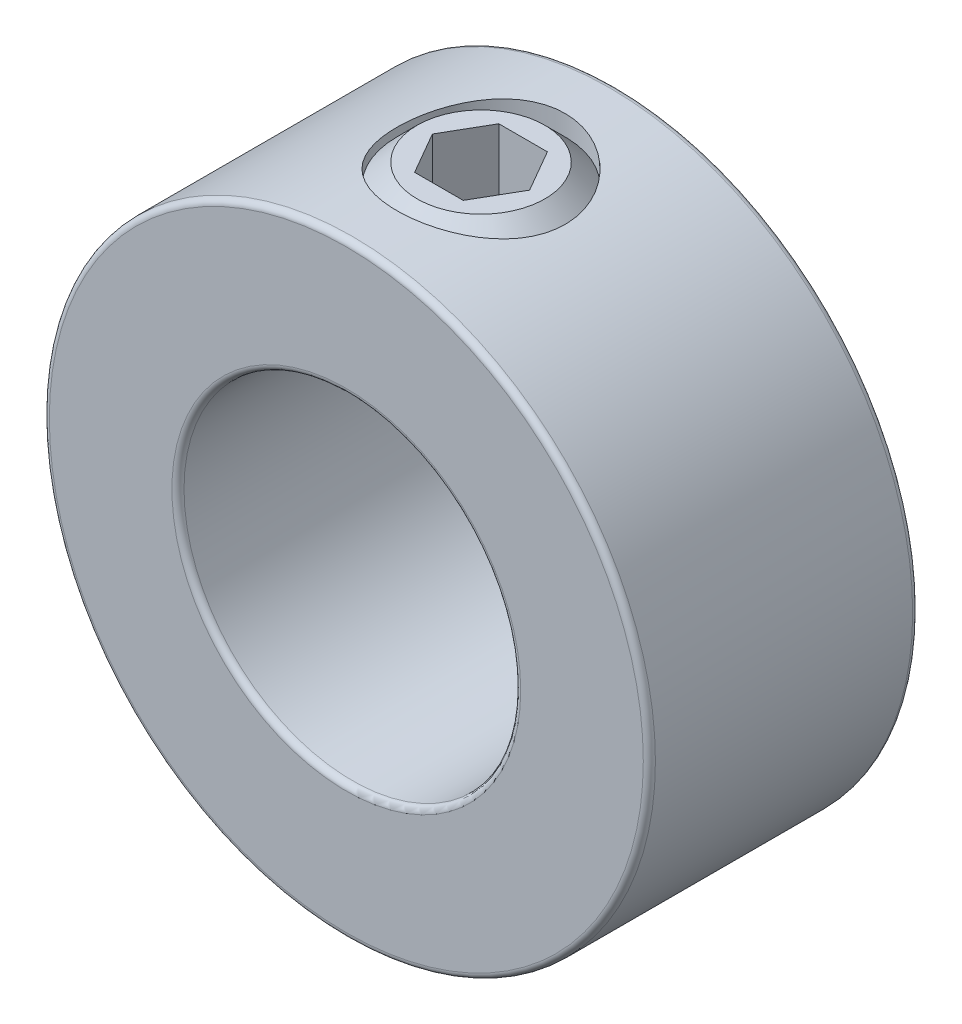
ISO-10303-21;
HEADER;
FILE_DESCRIPTION(('STEP AP214'),'2;1');
FILE_NAME('part.step','',(''),(''),'','','');
FILE_SCHEMA(('AUTOMOTIVE_DESIGN { 1 0 10303 214 1 1 1 1 }'));
ENDSEC;
DATA;
#1=APPLICATION_CONTEXT('core data for automotive mechanical design processes');
#2=APPLICATION_PROTOCOL_DEFINITION('international standard','automotive_design',2000,#1);
#3=PRODUCT_CONTEXT('',#1,'mechanical');
#4=PRODUCT('Part','Part','',(#3));
#5=PRODUCT_RELATED_PRODUCT_CATEGORY('part','',(#4));
#6=PRODUCT_DEFINITION_FORMATION('','',#4);
#7=PRODUCT_DEFINITION_CONTEXT('part definition',#1,'design');
#8=PRODUCT_DEFINITION('design','',#6,#7);
#9=PRODUCT_DEFINITION_SHAPE('','',#8);
#10=(LENGTH_UNIT() NAMED_UNIT(*) SI_UNIT(.MILLI.,.METRE.));
#11=(NAMED_UNIT(*) PLANE_ANGLE_UNIT() SI_UNIT($,.RADIAN.));
#12=(NAMED_UNIT(*) SI_UNIT($,.STERADIAN.) SOLID_ANGLE_UNIT());
#13=UNCERTAINTY_MEASURE_WITH_UNIT(LENGTH_MEASURE(1.E-05),#10,'distance_accuracy_value','');
#14=(GEOMETRIC_REPRESENTATION_CONTEXT(3) GLOBAL_UNCERTAINTY_ASSIGNED_CONTEXT((#13)) GLOBAL_UNIT_ASSIGNED_CONTEXT((#10,
#11,#12)) REPRESENTATION_CONTEXT('',''));
#15=CARTESIAN_POINT('',(0.,0.,0.));
#16=DIRECTION('',(0.,0.,1.));
#17=DIRECTION('',(1.,0.,0.));
#18=AXIS2_PLACEMENT_3D('',#15,#16,#17);
#19=CARTESIAN_POINT('',(0.,14.2875,0.));
#20=DIRECTION('',(0.,1.,0.));
#21=DIRECTION('',(-1.,0.,0.));
#22=AXIS2_PLACEMENT_3D('',#19,#20,#21);
#23=PLANE('',#22);
#24=CARTESIAN_POINT('',(0.,14.2875,0.));
#25=DIRECTION('',(0.,1.,0.));
#26=DIRECTION('',(-1.,0.,0.));
#27=AXIS2_PLACEMENT_3D('',#24,#25,#26);
#28=CIRCLE('',#27,3.01024078905505);
#29=CARTESIAN_POINT('',(-3.01024078905505,14.2875,0.));
#30=VERTEX_POINT('',#29);
#31=EDGE_CURVE('E125',#30,#30,#28,.T.);
#32=ORIENTED_EDGE('',*,*,#31,.T.);
#33=EDGE_LOOP('',(#32));
#34=FACE_BOUND('',#33,.T.);
#35=DIRECTION('',(1.,0.,0.));
#36=VECTOR('',#35,1.);
#37=CARTESIAN_POINT('',(-1.14567944042316,14.2875,-1.984375));
#38=LINE('',#37,#36);
#39=CARTESIAN_POINT('',(-1.14567944042316,14.2875,-1.984375));
#40=VERTEX_POINT('',#39);
#41=CARTESIAN_POINT('',(1.14567944042316,14.2875,-1.984375));
#42=VERTEX_POINT('',#41);
#43=EDGE_CURVE('E120',#40,#42,#38,.T.);
#44=ORIENTED_EDGE('',*,*,#43,.T.);
#45=DIRECTION('',(0.5,0.,0.866025403784439));
#46=VECTOR('',#45,1.);
#47=CARTESIAN_POINT('',(1.14567944042316,14.2875,-1.984375));
#48=LINE('',#47,#46);
#49=CARTESIAN_POINT('',(2.29135888084633,14.2875,0.));
#50=VERTEX_POINT('',#49);
#51=EDGE_CURVE('E66',#42,#50,#48,.T.);
#52=ORIENTED_EDGE('',*,*,#51,.T.);
#53=DIRECTION('',(-0.5,0.,0.866025403784439));
#54=VECTOR('',#53,1.);
#55=CARTESIAN_POINT('',(2.29135888084633,14.2875,0.));
#56=LINE('',#55,#54);
#57=CARTESIAN_POINT('',(1.14567944042317,14.2875,1.984375));
#58=VERTEX_POINT('',#57);
#59=EDGE_CURVE('E124',#50,#58,#56,.T.);
#60=ORIENTED_EDGE('',*,*,#59,.T.);
#61=DIRECTION('',(-1.,0.,0.));
#62=VECTOR('',#61,1.);
#63=CARTESIAN_POINT('',(1.14567944042317,14.2875,1.984375));
#64=LINE('',#63,#62);
#65=CARTESIAN_POINT('',(-1.14567944042316,14.2875,1.984375));
#66=VERTEX_POINT('',#65);
#67=EDGE_CURVE('E248',#58,#66,#64,.T.);
#68=ORIENTED_EDGE('',*,*,#67,.T.);
#69=DIRECTION('',(-0.5,0.,-0.866025403784439));
#70=VECTOR('',#69,1.);
#71=CARTESIAN_POINT('',(-1.14567944042316,14.2875,1.984375));
#72=LINE('',#71,#70);
#73=CARTESIAN_POINT('',(-2.29135888084633,14.2875,0.));
#74=VERTEX_POINT('',#73);
#75=EDGE_CURVE('E245',#66,#74,#72,.T.);
#76=ORIENTED_EDGE('',*,*,#75,.T.);
#77=DIRECTION('',(0.5,0.,-0.866025403784439));
#78=VECTOR('',#77,1.);
#79=CARTESIAN_POINT('',(-2.29135888084633,14.2875,0.));
#80=LINE('',#79,#78);
#81=EDGE_CURVE('E239',#74,#40,#80,.T.);
#82=ORIENTED_EDGE('',*,*,#81,.T.);
#83=EDGE_LOOP('',(#44,#52,#60,#68,#76,#82));
#84=FACE_BOUND('',#83,.T.);
#85=ADVANCED_FACE('F51',(#34,#84),#23,.T.);
#86=CARTESIAN_POINT('',(0.,7.9375,0.));
#87=DIRECTION('',(0.,-1.,0.));
#88=DIRECTION('',(1.,0.,0.));
#89=AXIS2_PLACEMENT_3D('',#86,#87,#88);
#90=CONICAL_SURFACE('',#89,1.15021105313395,0.785398163397449);
#91=CARTESIAN_POINT('',(0.,9.08771105313395,0.));
#92=VERTEX_POINT('',#91);
#93=VERTEX_LOOP('',#92);
#94=FACE_BOUND('',#93,.T.);
#95=CARTESIAN_POINT('',(0.,7.9375,0.));
#96=DIRECTION('',(0.,1.,0.));
#97=DIRECTION('',(-1.,0.,0.));
#98=AXIS2_PLACEMENT_3D('',#95,#96,#97);
#99=CIRCLE('',#98,1.15021105313395);
#100=CARTESIAN_POINT('',(-1.15021105313395,7.9375,0.));
#101=VERTEX_POINT('',#100);
#102=EDGE_CURVE('E12',#101,#101,#99,.T.);
#103=ORIENTED_EDGE('',*,*,#102,.F.);
#104=EDGE_LOOP('',(#103));
#105=FACE_BOUND('',#104,.T.);
#106=ADVANCED_FACE('F53',(#94,#105),#90,.F.);
#107=CARTESIAN_POINT('',(-3.01024078905505,7.9375,0.));
#108=DIRECTION('',(0.,-1.,0.));
#109=DIRECTION('',(1.,0.,0.));
#110=AXIS2_PLACEMENT_3D('',#107,#108,#109);
#111=PLANE('',#110);
#112=ORIENTED_EDGE('',*,*,#102,.T.);
#113=EDGE_LOOP('',(#112));
#114=FACE_BOUND('',#113,.T.);
#115=CARTESIAN_POINT('',(0.,7.9375,0.));
#116=DIRECTION('',(0.,1.,0.));
#117=DIRECTION('',(-1.,0.,0.));
#118=AXIS2_PLACEMENT_3D('',#115,#116,#117);
#119=CIRCLE('',#118,3.01024078905505);
#120=CARTESIAN_POINT('',(-3.01024078905505,7.9375,0.));
#121=VERTEX_POINT('',#120);
#122=EDGE_CURVE('E59',#121,#121,#119,.T.);
#123=ORIENTED_EDGE('',*,*,#122,.F.);
#124=EDGE_LOOP('',(#123));
#125=FACE_BOUND('',#124,.T.);
#126=ADVANCED_FACE('F145',(#114,#125),#111,.T.);
#127=CARTESIAN_POINT('',(0.,8.89600921094495,0.));
#128=DIRECTION('',(0.,1.,0.));
#129=DIRECTION('',(-1.,0.,0.));
#130=AXIS2_PLACEMENT_3D('',#127,#128,#129);
#131=CONICAL_SURFACE('',#130,3.96875,0.785398163397449);
#132=ORIENTED_EDGE('',*,*,#122,.T.);
#133=EDGE_LOOP('',(#132));
#134=FACE_BOUND('',#133,.T.);
#135=CARTESIAN_POINT('',(0.,8.89600921094495,0.));
#136=DIRECTION('',(0.,1.,0.));
#137=DIRECTION('',(-1.,0.,0.));
#138=AXIS2_PLACEMENT_3D('',#135,#136,#137);
#139=CIRCLE('',#138,3.96875);
#140=CARTESIAN_POINT('',(-3.96875,8.89600921094495,0.));
#141=VERTEX_POINT('',#140);
#142=EDGE_CURVE('E137',#141,#141,#139,.T.);
#143=ORIENTED_EDGE('',*,*,#142,.F.);
#144=EDGE_LOOP('',(#143));
#145=FACE_BOUND('',#144,.T.);
#146=ADVANCED_FACE('F142',(#134,#145),#131,.T.);
#147=CARTESIAN_POINT('',(0.,7.9375,0.));
#148=DIRECTION('',(0.,1.,0.));
#149=DIRECTION('',(-1.,0.,0.));
#150=AXIS2_PLACEMENT_3D('',#147,#148,#149);
#151=CYLINDRICAL_SURFACE('',#150,3.96875);
#152=ORIENTED_EDGE('',*,*,#142,.T.);
#153=EDGE_LOOP('',(#152));
#154=FACE_BOUND('',#153,.T.);
#155=CARTESIAN_POINT('',(0.,13.328990789055,0.));
#156=DIRECTION('',(0.,1.,0.));
#157=DIRECTION('',(-1.,0.,0.));
#158=AXIS2_PLACEMENT_3D('',#155,#156,#157);
#159=CIRCLE('',#158,3.96875);
#160=CARTESIAN_POINT('',(-3.96875,13.328990789055,0.));
#161=VERTEX_POINT('',#160);
#162=EDGE_CURVE('E129',#161,#161,#159,.T.);
#163=ORIENTED_EDGE('',*,*,#162,.F.);
#164=EDGE_LOOP('',(#163));
#165=FACE_BOUND('',#164,.T.);
#166=ADVANCED_FACE('F152',(#154,#165),#151,.T.);
#167=CARTESIAN_POINT('',(0.,14.2875,0.));
#168=DIRECTION('',(0.,-1.,0.));
#169=DIRECTION('',(1.,0.,0.));
#170=AXIS2_PLACEMENT_3D('',#167,#168,#169);
#171=CONICAL_SURFACE('',#170,3.01024078905505,0.785398163397448);
#172=ORIENTED_EDGE('',*,*,#162,.T.);
#173=EDGE_LOOP('',(#172));
#174=FACE_BOUND('',#173,.T.);
#175=ORIENTED_EDGE('',*,*,#31,.F.);
#176=EDGE_LOOP('',(#175));
#177=FACE_BOUND('',#176,.T.);
#178=ADVANCED_FACE('F165',(#174,#177),#171,.T.);
#179=CARTESIAN_POINT('',(1.14567944042316,10.31875,-1.984375));
#180=DIRECTION('',(-0.866025403784439,0.,0.5));
#181=DIRECTION('',(0.5,0.,0.866025403784439));
#182=AXIS2_PLACEMENT_3D('',#179,#180,#181);
#183=PLANE('',#182);
#184=ORIENTED_EDGE('',*,*,#51,.F.);
#185=DIRECTION('',(0.,1.,0.));
#186=VECTOR('',#185,1.);
#187=CARTESIAN_POINT('',(1.14567944042316,10.31875,-1.984375));
#188=LINE('',#187,#186);
#189=CARTESIAN_POINT('',(1.14567944042316,10.31875,-1.984375));
#190=VERTEX_POINT('',#189);
#191=EDGE_CURVE('E119',#190,#42,#188,.T.);
#192=ORIENTED_EDGE('',*,*,#191,.F.);
#193=DIRECTION('',(0.5,0.,0.866025403784439));
#194=VECTOR('',#193,1.);
#195=CARTESIAN_POINT('',(1.14567944042316,10.31875,-1.984375));
#196=LINE('',#195,#194);
#197=CARTESIAN_POINT('',(2.29135888084633,10.31875,0.));
#198=VERTEX_POINT('',#197);
#199=EDGE_CURVE('E110',#190,#198,#196,.T.);
#200=ORIENTED_EDGE('',*,*,#199,.T.);
#201=DIRECTION('',(0.,1.,0.));
#202=VECTOR('',#201,1.);
#203=CARTESIAN_POINT('',(2.29135888084633,10.31875,0.));
#204=LINE('',#203,#202);
#205=EDGE_CURVE('E118',#198,#50,#204,.T.);
#206=ORIENTED_EDGE('',*,*,#205,.T.);
#207=EDGE_LOOP('',(#184,#192,#200,#206));
#208=FACE_BOUND('',#207,.T.);
#209=ADVANCED_FACE('F117',(#208),#183,.T.);
#210=CARTESIAN_POINT('',(2.29135888084633,10.31875,0.));
#211=DIRECTION('',(-0.866025403784439,0.,-0.5));
#212=DIRECTION('',(-0.5,0.,0.866025403784439));
#213=AXIS2_PLACEMENT_3D('',#210,#211,#212);
#214=PLANE('',#213);
#215=ORIENTED_EDGE('',*,*,#59,.F.);
#216=ORIENTED_EDGE('',*,*,#205,.F.);
#217=DIRECTION('',(-0.5,0.,0.866025403784439));
#218=VECTOR('',#217,1.);
#219=CARTESIAN_POINT('',(2.29135888084633,10.31875,0.));
#220=LINE('',#219,#218);
#221=CARTESIAN_POINT('',(1.14567944042317,10.31875,1.984375));
#222=VERTEX_POINT('',#221);
#223=EDGE_CURVE('E106',#198,#222,#220,.T.);
#224=ORIENTED_EDGE('',*,*,#223,.T.);
#225=DIRECTION('',(0.,1.,0.));
#226=VECTOR('',#225,1.);
#227=CARTESIAN_POINT('',(1.14567944042317,10.31875,1.984375));
#228=LINE('',#227,#226);
#229=EDGE_CURVE('E126',#222,#58,#228,.T.);
#230=ORIENTED_EDGE('',*,*,#229,.T.);
#231=EDGE_LOOP('',(#215,#216,#224,#230));
#232=FACE_BOUND('',#231,.T.);
#233=ADVANCED_FACE('F122',(#232),#214,.T.);
#234=CARTESIAN_POINT('',(1.14567944042317,10.31875,1.984375));
#235=DIRECTION('',(0.,0.,-1.));
#236=DIRECTION('',(-1.,0.,0.));
#237=AXIS2_PLACEMENT_3D('',#234,#235,#236);
#238=PLANE('',#237);
#239=ORIENTED_EDGE('',*,*,#67,.F.);
#240=ORIENTED_EDGE('',*,*,#229,.F.);
#241=DIRECTION('',(-1.,0.,0.));
#242=VECTOR('',#241,1.);
#243=CARTESIAN_POINT('',(1.14567944042317,10.31875,1.984375));
#244=LINE('',#243,#242);
#245=CARTESIAN_POINT('',(-1.14567944042316,10.31875,1.984375));
#246=VERTEX_POINT('',#245);
#247=EDGE_CURVE('E112',#222,#246,#244,.T.);
#248=ORIENTED_EDGE('',*,*,#247,.T.);
#249=DIRECTION('',(0.,1.,0.));
#250=VECTOR('',#249,1.);
#251=CARTESIAN_POINT('',(-1.14567944042316,10.31875,1.984375));
#252=LINE('',#251,#250);
#253=EDGE_CURVE('E131',#246,#66,#252,.T.);
#254=ORIENTED_EDGE('',*,*,#253,.T.);
#255=EDGE_LOOP('',(#239,#240,#248,#254));
#256=FACE_BOUND('',#255,.T.);
#257=ADVANCED_FACE('F196',(#256),#238,.T.);
#258=CARTESIAN_POINT('',(-1.14567944042316,10.31875,1.984375));
#259=DIRECTION('',(0.866025403784439,0.,-0.5));
#260=DIRECTION('',(-0.5,0.,-0.866025403784439));
#261=AXIS2_PLACEMENT_3D('',#258,#259,#260);
#262=PLANE('',#261);
#263=ORIENTED_EDGE('',*,*,#75,.F.);
#264=ORIENTED_EDGE('',*,*,#253,.F.);
#265=DIRECTION('',(-0.5,0.,-0.866025403784439));
#266=VECTOR('',#265,1.);
#267=CARTESIAN_POINT('',(-1.14567944042316,10.31875,1.984375));
#268=LINE('',#267,#266);
#269=CARTESIAN_POINT('',(-2.29135888084633,10.31875,0.));
#270=VERTEX_POINT('',#269);
#271=EDGE_CURVE('E264',#246,#270,#268,.T.);
#272=ORIENTED_EDGE('',*,*,#271,.T.);
#273=DIRECTION('',(0.,1.,0.));
#274=VECTOR('',#273,1.);
#275=CARTESIAN_POINT('',(-2.29135888084633,10.31875,0.));
#276=LINE('',#275,#274);
#277=EDGE_CURVE('E255',#270,#74,#276,.T.);
#278=ORIENTED_EDGE('',*,*,#277,.T.);
#279=EDGE_LOOP('',(#263,#264,#272,#278));
#280=FACE_BOUND('',#279,.T.);
#281=ADVANCED_FACE('F202',(#280),#262,.T.);
#282=CARTESIAN_POINT('',(-2.29135888084633,10.31875,0.));
#283=DIRECTION('',(0.866025403784439,0.,0.5));
#284=DIRECTION('',(0.5,0.,-0.866025403784439));
#285=AXIS2_PLACEMENT_3D('',#282,#283,#284);
#286=PLANE('',#285);
#287=ORIENTED_EDGE('',*,*,#81,.F.);
#288=ORIENTED_EDGE('',*,*,#277,.F.);
#289=DIRECTION('',(0.5,0.,-0.866025403784439));
#290=VECTOR('',#289,1.);
#291=CARTESIAN_POINT('',(-2.29135888084633,10.31875,0.));
#292=LINE('',#291,#290);
#293=CARTESIAN_POINT('',(-1.14567944042316,10.31875,-1.984375));
#294=VERTEX_POINT('',#293);
#295=EDGE_CURVE('E262',#270,#294,#292,.T.);
#296=ORIENTED_EDGE('',*,*,#295,.T.);
#297=DIRECTION('',(0.,1.,0.));
#298=VECTOR('',#297,1.);
#299=CARTESIAN_POINT('',(-1.14567944042316,10.31875,-1.984375));
#300=LINE('',#299,#298);
#301=EDGE_CURVE('E238',#294,#40,#300,.T.);
#302=ORIENTED_EDGE('',*,*,#301,.T.);
#303=EDGE_LOOP('',(#287,#288,#296,#302));
#304=FACE_BOUND('',#303,.T.);
#305=ADVANCED_FACE('F210',(#304),#286,.T.);
#306=CARTESIAN_POINT('',(-1.14567944042316,10.31875,-1.984375));
#307=DIRECTION('',(0.,0.,1.));
#308=DIRECTION('',(1.,0.,0.));
#309=AXIS2_PLACEMENT_3D('',#306,#307,#308);
#310=PLANE('',#309);
#311=ORIENTED_EDGE('',*,*,#43,.F.);
#312=ORIENTED_EDGE('',*,*,#301,.F.);
#313=DIRECTION('',(1.,0.,0.));
#314=VECTOR('',#313,1.);
#315=CARTESIAN_POINT('',(-1.14567944042316,10.31875,-1.984375));
#316=LINE('',#315,#314);
#317=EDGE_CURVE('E253',#294,#190,#316,.T.);
#318=ORIENTED_EDGE('',*,*,#317,.T.);
#319=ORIENTED_EDGE('',*,*,#191,.T.);
#320=EDGE_LOOP('',(#311,#312,#318,#319));
#321=FACE_BOUND('',#320,.T.);
#322=ADVANCED_FACE('F218',(#321),#310,.T.);
#323=CARTESIAN_POINT('',(3.43703832126949,10.31875,1.984375));
#324=DIRECTION('',(0.,-1.,0.));
#325=DIRECTION('',(0.,0.,-1.));
#326=AXIS2_PLACEMENT_3D('',#323,#324,#325);
#327=PLANE('',#326);
#328=ORIENTED_EDGE('',*,*,#199,.F.);
#329=ORIENTED_EDGE('',*,*,#317,.F.);
#330=ORIENTED_EDGE('',*,*,#295,.F.);
#331=ORIENTED_EDGE('',*,*,#271,.F.);
#332=ORIENTED_EDGE('',*,*,#247,.F.);
#333=ORIENTED_EDGE('',*,*,#223,.F.);
#334=EDGE_LOOP('',(#328,#329,#330,#331,#332,#333));
#335=FACE_BOUND('',#334,.T.);
#336=ADVANCED_FACE('F108',(#335),#327,.F.);
#337=CLOSED_SHELL('',(#85,#106,#126,#146,#166,#178,#209,#233,#257,#281,#305,#322,#336));
#338=MANIFOLD_SOLID_BREP('B2',#337);
#339=CARTESIAN_POINT('',(0.,0.,6.35));
#340=DIRECTION('',(0.,0.,1.));
#341=DIRECTION('',(1.,0.,0.));
#342=AXIS2_PLACEMENT_3D('',#339,#340,#341);
#343=PLANE('',#342);
#344=CARTESIAN_POINT('',(0.,0.,6.35));
#345=DIRECTION('',(0.,0.,1.));
#346=DIRECTION('',(1.,0.,0.));
#347=AXIS2_PLACEMENT_3D('',#344,#345,#346);
#348=CIRCLE('',#347,8.22325);
#349=CARTESIAN_POINT('',(8.22325,0.,6.35));
#350=VERTEX_POINT('',#349);
#351=EDGE_CURVE('E291',#350,#350,#348,.F.);
#352=ORIENTED_EDGE('',*,*,#351,.T.);
#353=EDGE_LOOP('',(#352));
#354=FACE_BOUND('',#353,.T.);
#355=CARTESIAN_POINT('',(0.,0.,6.35));
#356=DIRECTION('',(0.,0.,1.));
#357=DIRECTION('',(1.,0.,0.));
#358=AXIS2_PLACEMENT_3D('',#355,#356,#357);
#359=CIRCLE('',#358,14.00175);
#360=CARTESIAN_POINT('',(14.00175,0.,6.35));
#361=VERTEX_POINT('',#360);
#362=EDGE_CURVE('E295',#361,#361,#359,.T.);
#363=ORIENTED_EDGE('',*,*,#362,.T.);
#364=EDGE_LOOP('',(#363));
#365=FACE_BOUND('',#364,.T.);
#366=ADVANCED_FACE('F280',(#354,#365),#343,.T.);
#367=CARTESIAN_POINT('',(0.,0.,-6.35));
#368=DIRECTION('',(0.,0.,1.));
#369=DIRECTION('',(1.,0.,0.));
#370=AXIS2_PLACEMENT_3D('',#367,#368,#369);
#371=PLANE('',#370);
#372=CARTESIAN_POINT('',(0.,0.,-6.35));
#373=DIRECTION('',(0.,0.,1.));
#374=DIRECTION('',(1.,0.,0.));
#375=AXIS2_PLACEMENT_3D('',#372,#373,#374);
#376=CIRCLE('',#375,8.22325);
#377=CARTESIAN_POINT('',(8.22325,0.,-6.35));
#378=VERTEX_POINT('',#377);
#379=EDGE_CURVE('E306',#378,#378,#376,.T.);
#380=ORIENTED_EDGE('',*,*,#379,.T.);
#381=EDGE_LOOP('',(#380));
#382=FACE_BOUND('',#381,.T.);
#383=CARTESIAN_POINT('',(0.,0.,-6.35));
#384=DIRECTION('',(0.,0.,1.));
#385=DIRECTION('',(1.,0.,0.));
#386=AXIS2_PLACEMENT_3D('',#383,#384,#385);
#387=CIRCLE('',#386,14.00175);
#388=CARTESIAN_POINT('',(14.00175,0.,-6.35));
#389=VERTEX_POINT('',#388);
#390=EDGE_CURVE('E309',#389,#389,#387,.F.);
#391=ORIENTED_EDGE('',*,*,#390,.T.);
#392=EDGE_LOOP('',(#391));
#393=FACE_BOUND('',#392,.T.);
#394=ADVANCED_FACE('F345',(#382,#393),#371,.F.);
#395=CARTESIAN_POINT('',(0.,0.,6.35));
#396=DIRECTION('',(0.,0.,-1.));
#397=DIRECTION('',(-1.,0.,0.));
#398=AXIS2_PLACEMENT_3D('',#395,#396,#397);
#399=CYLINDRICAL_SURFACE('',#398,14.2875);
#400=CARTESIAN_POINT('',(0.,0.,-6.06425));
#401=DIRECTION('',(0.,0.,1.));
#402=DIRECTION('',(1.,0.,0.));
#403=AXIS2_PLACEMENT_3D('',#400,#401,#402);
#404=CIRCLE('',#403,14.2875);
#405=CARTESIAN_POINT('',(14.2875,0.,-6.06425));
#406=VERTEX_POINT('',#405);
#407=EDGE_CURVE('E50',#406,#406,#404,.T.);
#408=ORIENTED_EDGE('',*,*,#407,.T.);
#409=EDGE_LOOP('',(#408));
#410=FACE_BOUND('',#409,.T.);
#411=CARTESIAN_POINT('',(0.,0.,6.06425));
#412=DIRECTION('',(0.,0.,1.));
#413=DIRECTION('',(1.,0.,0.));
#414=AXIS2_PLACEMENT_3D('',#411,#412,#413);
#415=CIRCLE('',#414,14.2875);
#416=CARTESIAN_POINT('',(14.2875,0.,6.06425));
#417=VERTEX_POINT('',#416);
#418=EDGE_CURVE('E287',#417,#417,#415,.F.);
#419=ORIENTED_EDGE('',*,*,#418,.T.);
#420=EDGE_LOOP('',(#419));
#421=FACE_BOUND('',#420,.T.);
#422=CARTESIAN_POINT('',(0.,14.2875,-3.96875));
#423=CARTESIAN_POINT('',(0.218443971554094,14.2874970795375,-3.9687455563169));
#424=CARTESIAN_POINT('',(0.436934367914718,14.2824414022569,-3.95065465961819));
#425=CARTESIAN_POINT('',(0.867598836281707,14.2627651687941,-3.87891106275761));
#426=CARTESIAN_POINT('',(1.07977020413142,14.2481405774891,-3.82524336005893));
#427=CARTESIAN_POINT('',(1.49151959023496,14.2109369512781,-3.6842423158608));
#428=CARTESIAN_POINT('',(1.69111418855375,14.188368658732,-3.59695442438257));
#429=CARTESIAN_POINT('',(2.07283270739263,14.1376499244794,-3.39136511741216));
#430=CARTESIAN_POINT('',(2.25495507482906,14.1094989872198,-3.27306094840623));
#431=CARTESIAN_POINT('',(2.60110854147304,14.0498562607013,-3.00567904754905));
#432=CARTESIAN_POINT('',(2.76464113316684,14.0183036125371,-2.85596952399255));
#433=CARTESIAN_POINT('',(3.06463123958594,13.9557952759881,-2.53137582013844));
#434=CARTESIAN_POINT('',(3.20108494543484,13.9248396721348,-2.35648810427424));
#435=CARTESIAN_POINT('',(3.44553567242501,13.8664011562938,-1.98244694909135));
#436=CARTESIAN_POINT('',(3.55294802959285,13.8389946720664,-1.78289836319845));
#437=CARTESIAN_POINT('',(3.73249688891467,13.7916571008822,-1.36768866148537));
#438=CARTESIAN_POINT('',(3.80464051542933,13.7717245043734,-1.15203080992701));
#439=CARTESIAN_POINT('',(3.9098513486844,13.7422217889887,-0.716271145392378));
#440=CARTESIAN_POINT('',(3.94382742170528,13.7324111276617,-0.496405466345519));
#441=CARTESIAN_POINT('',(3.97457380971881,13.7235453650401,-0.0538928134019439));
#442=CARTESIAN_POINT('',(3.97135172286719,13.7244880672456,0.168753583219997));
#443=CARTESIAN_POINT('',(3.92851231497134,13.7368078966957,0.603320734948872));
#444=CARTESIAN_POINT('',(3.89000689709432,13.7478662264285,0.815361594751626));
#445=CARTESIAN_POINT('',(3.77947971565998,13.7786591662469,1.22984777077717));
#446=CARTESIAN_POINT('',(3.70745507101462,13.7983945221434,1.43229226051185));
#447=CARTESIAN_POINT('',(3.53105634701941,13.8445897154349,1.82467958487083));
#448=CARTESIAN_POINT('',(3.42630194332451,13.871127915571,2.01444182712201));
#449=CARTESIAN_POINT('',(3.18768224157839,13.9278979342118,2.37407950250212));
#450=CARTESIAN_POINT('',(3.05381077797265,13.958130534413,2.54395071195546));
#451=CARTESIAN_POINT('',(2.75512406265311,14.0201990400309,2.86532282038565));
#452=CARTESIAN_POINT('',(2.58937848805498,14.052053748701,3.01595674074354));
#453=CARTESIAN_POINT('',(2.23458597786329,14.1128178439927,3.28747669521954));
#454=CARTESIAN_POINT('',(2.04553796321474,14.1417270941071,3.40836135097537));
#455=CARTESIAN_POINT('',(1.64808988814852,14.1935466608803,3.61737851462549));
#456=CARTESIAN_POINT('',(1.4395970564991,14.2164259944957,3.70534280500603));
#457=CARTESIAN_POINT('',(1.00999921434385,14.2533843869208,3.84471576255134));
#458=CARTESIAN_POINT('',(0.78889721608459,14.2674655380275,3.8961331213471));
#459=CARTESIAN_POINT('',(0.347746979489227,14.2849198833482,3.95956515927325));
#460=CARTESIAN_POINT('',(0.127880446101315,14.2886129589129,3.97275731008026));
#461=CARTESIAN_POINT('',(-0.310927529771102,14.2858007493079,3.96263178042154));
#462=CARTESIAN_POINT('',(-0.52986907387835,14.2792966152821,3.93931822101743));
#463=CARTESIAN_POINT('',(-0.956331950269976,14.2570284156239,3.85780491417017));
#464=CARTESIAN_POINT('',(-1.16399083992026,14.2414414550698,3.80027197444243));
#465=CARTESIAN_POINT('',(-1.56668190002696,14.2027855761279,3.652736320249));
#466=CARTESIAN_POINT('',(-1.76171264361239,14.1797158140119,3.56272994409161));
#467=CARTESIAN_POINT('',(-2.13810894578712,14.1279162540193,3.35068583720259));
#468=CARTESIAN_POINT('',(-2.31910592170221,14.0990787150506,3.22802083527632));
#469=CARTESIAN_POINT('',(-2.65835660411401,14.0390713988331,2.95492126881052));
#470=CARTESIAN_POINT('',(-2.81660541145569,14.007901121386,2.80448073828826));
#471=CARTESIAN_POINT('',(-3.11090318554911,13.9455475051814,2.47459041568929));
#472=CARTESIAN_POINT('',(-3.24611866285671,13.9143933104224,2.29439009131624));
#473=CARTESIAN_POINT('',(-3.4844222103752,13.8566427625908,1.91318947472034));
#474=CARTESIAN_POINT('',(-3.58751150933388,13.8300462352162,1.71218997840674));
#475=CARTESIAN_POINT('',(-3.75786986022478,13.784732366187,1.29601223564908));
#476=CARTESIAN_POINT('',(-3.82533771009336,13.7659714208028,1.08092037525792));
#477=CARTESIAN_POINT('',(-3.9229554666793,13.738475089142,0.641827172744165));
#478=CARTESIAN_POINT('',(-3.95311591602425,13.7297368706127,0.417828366094963));
#479=CARTESIAN_POINT('',(-3.9746193041937,13.7235259670579,-0.0241483499340404));
#480=CARTESIAN_POINT('',(-3.96730762970401,13.7256628079239,-0.242056253359612));
#481=CARTESIAN_POINT('',(-3.91722429935622,13.740039099373,-0.673401287848073));
#482=CARTESIAN_POINT('',(-3.87445370806734,13.7522782466583,-0.88683855293396));
#483=CARTESIAN_POINT('',(-3.75547649489872,13.7852378226909,-1.30132846766945));
#484=CARTESIAN_POINT('',(-3.67957781485687,13.8058800246405,-1.50247617540115));
#485=CARTESIAN_POINT('',(-3.49673709054442,13.8533160845087,-1.88933906646621));
#486=CARTESIAN_POINT('',(-3.38978980913797,13.8801109800759,-2.07505163946854));
#487=CARTESIAN_POINT('',(-3.14390710441698,13.9378947424762,-2.43213779771838));
#488=CARTESIAN_POINT('',(-3.0040646177995,13.9689896826976,-2.60286968846723));
#489=CARTESIAN_POINT('',(-2.69805634965575,14.0313039131114,-2.91888028127014));
#490=CARTESIAN_POINT('',(-2.53188405111948,14.0625232322194,-3.06415266292899));
#491=CARTESIAN_POINT('',(-2.17316123757756,14.1224584067172,-3.32853708363529));
#492=CARTESIAN_POINT('',(-1.98007687210966,14.1510969578719,-3.44694390401138));
#493=CARTESIAN_POINT('',(-1.57594929504977,14.2017742030934,-3.64943434224411));
#494=CARTESIAN_POINT('',(-1.3649167208111,14.2238167718717,-3.73353812149474));
#495=CARTESIAN_POINT('',(-0.962486910959275,14.2562603759146,-3.85514875633266));
#496=CARTESIAN_POINT('',(-0.772681976885754,14.2678862997639,-3.89764520060737));
#497=CARTESIAN_POINT('',(-0.388596586576574,14.283506960497,-3.95444613548657));
#498=CARTESIAN_POINT('',(-0.194316661211643,14.2875025978951,-3.96875395287477));
#499=CARTESIAN_POINT('',(0.,14.2875,-3.96875));
#500=B_SPLINE_CURVE_WITH_KNOTS('',3,(#422,#423,#424,#425,#426,#427,#428,#429,#430,#431,#432,
#433,#434,#435,#436,#437,#438,#439,#440,#441,#442,#443,#444,#445,#446,#447,#448,#449,#450,#451,
#452,#453,#454,#455,#456,#457,#458,#459,#460,#461,#462,#463,#464,#465,#466,#467,#468,#469,#470,
#471,#472,#473,#474,#475,#476,#477,#478,#479,#480,#481,#482,#483,#484,#485,#486,#487,#488,#489,
#490,#491,#492,#493,#494,#495,#496,#497,#498,#499),.UNSPECIFIED.,.T.,.F.,(4,2,2,2,2,2,2,2,2,2,2,
2,2,2,2,2,2,2,2,2,2,2,2,2,2,2,2,2,2,2,2,2,2,2,2,2,2,2,4),(0.,0.654618938090882,1.30951410101755,
1.96352702271856,2.61759802501043,3.28636707232713,3.95523012114685,4.63669666777658,
5.31802549973495,5.98276146413783,6.6473616509106,7.2917123975849,7.93611853856212,
8.58831023142982,9.24064016095644,9.91614392950064,10.5916789900351,11.2706202590804,
11.9494000075017,12.6070363363216,13.2645984311532,13.9097485800492,14.5549714985655,
15.2136141272132,15.8723983924696,16.5514652367045,17.2305061051044,17.9057161843002,
18.5807354135371,19.2316925262891,19.8826300963172,20.5276416207276,21.1727620060019,
21.838345746766,22.5040944872385,23.1856943763891,23.8668930802509,24.4492775724935,
25.0315933283862),.UNSPECIFIED.);
#501=CARTESIAN_POINT('',(0.,14.2875,-3.96875));
#502=VERTEX_POINT('',#501);
#503=EDGE_CURVE('E312',#502,#502,#500,.T.);
#504=ORIENTED_EDGE('',*,*,#503,.T.);
#505=EDGE_LOOP('',(#504));
#506=FACE_BOUND('',#505,.T.);
#507=ADVANCED_FACE('F342',(#410,#421,#506),#399,.T.);
#508=CARTESIAN_POINT('',(0.,0.,6.35));
#509=DIRECTION('',(0.,0.,-1.));
#510=DIRECTION('',(-1.,0.,0.));
#511=AXIS2_PLACEMENT_3D('',#508,#509,#510);
#512=CYLINDRICAL_SURFACE('',#511,7.9375);
#513=CARTESIAN_POINT('',(0.,0.,-6.06425));
#514=DIRECTION('',(0.,0.,1.));
#515=DIRECTION('',(1.,0.,0.));
#516=AXIS2_PLACEMENT_3D('',#513,#514,#515);
#517=CIRCLE('',#516,7.9375);
#518=CARTESIAN_POINT('',(7.9375,0.,-6.06425));
#519=VERTEX_POINT('',#518);
#520=EDGE_CURVE('E300',#519,#519,#517,.F.);
#521=ORIENTED_EDGE('',*,*,#520,.T.);
#522=EDGE_LOOP('',(#521));
#523=FACE_BOUND('',#522,.T.);
#524=CARTESIAN_POINT('',(0.,0.,6.06425));
#525=DIRECTION('',(0.,0.,1.));
#526=DIRECTION('',(1.,0.,0.));
#527=AXIS2_PLACEMENT_3D('',#524,#525,#526);
#528=CIRCLE('',#527,7.9375);
#529=CARTESIAN_POINT('',(7.9375,0.,6.06425));
#530=VERTEX_POINT('',#529);
#531=EDGE_CURVE('E303',#530,#530,#528,.T.);
#532=ORIENTED_EDGE('',*,*,#531,.T.);
#533=EDGE_LOOP('',(#532));
#534=FACE_BOUND('',#533,.T.);
#535=CARTESIAN_POINT('',(0.,7.9375,-3.96875));
#536=CARTESIAN_POINT('',(0.104369410089828,7.93749964710061,-3.96874959831509));
#537=CARTESIAN_POINT('',(0.208746323529612,7.93543652404866,-3.96462799938244));
#538=CARTESIAN_POINT('',(0.416729911813044,7.9272367842324,-3.94818981313592));
#539=CARTESIAN_POINT('',(0.520336231742605,7.92109839537058,-3.93586966073959));
#540=CARTESIAN_POINT('',(0.726110731039584,7.90489272677887,-3.90315299713828));
#541=CARTESIAN_POINT('',(0.82827664337823,7.89481984439238,-3.88274496831698));
#542=CARTESIAN_POINT('',(1.03030258640491,7.87100738632354,-3.8340930831276));
#543=CARTESIAN_POINT('',(1.13016165631416,7.8572663117564,-3.80584602341294));
#544=CARTESIAN_POINT('',(1.42440199017918,7.81115458867984,-3.71003886443782));
#545=CARTESIAN_POINT('',(1.61448373622076,7.77380867280489,-3.63124454244051));
#546=CARTESIAN_POINT('',(1.9783439584702,7.68928332519479,-3.44657259204585));
#547=CARTESIAN_POINT('',(2.15212371864541,7.64210466884467,-3.34069709905159));
#548=CARTESIAN_POINT('',(2.49041365625515,7.53888923529746,-3.0975400978896));
#549=CARTESIAN_POINT('',(2.65372701475933,7.48248923455529,-2.95874609843218));
#550=CARTESIAN_POINT('',(2.95584177494966,7.36838155110921,-2.65700357442673));
#551=CARTESIAN_POINT('',(3.09462449787671,7.31067290934779,-2.49403681579299));
#552=CARTESIAN_POINT('',(3.3546096064078,7.19529548141556,-2.13322397370708));
#553=CARTESIAN_POINT('',(3.47361399641898,7.13797684614345,-1.93365308091488));
#554=CARTESIAN_POINT('',(3.62524200471708,7.06149696460579,-1.61931494863912));
#555=CARTESIAN_POINT('',(3.6713159275105,7.03758021096291,-1.51199982674657));
#556=CARTESIAN_POINT('',(3.7540313686651,6.99380755132026,-1.29301778650766));
#557=CARTESIAN_POINT('',(3.7906784717335,6.973949242426,-1.18135349009291));
#558=CARTESIAN_POINT('',(3.85217834905982,6.94015758970911,-0.961236985532085));
#559=CARTESIAN_POINT('',(3.8776017912118,6.92594266308114,-0.852987146610149));
#560=CARTESIAN_POINT('',(3.91931981478622,6.90242088712119,-0.634265262514365));
#561=CARTESIAN_POINT('',(3.93561923963159,6.89311143390609,-0.523794428667328));
#562=CARTESIAN_POINT('',(3.95884711357792,6.87979769947166,-0.301618954139092));
#563=CARTESIAN_POINT('',(3.96578120630086,6.87579022326954,-0.189915097443525));
#564=CARTESIAN_POINT('',(3.97018212403133,6.87325014427843,0.0337348493040591));
#565=CARTESIAN_POINT('',(3.96764985229861,6.87471701913886,0.145680915226328));
#566=CARTESIAN_POINT('',(3.95403164408641,6.882557023164,0.355366219239711));
#567=CARTESIAN_POINT('',(3.94400811209084,6.88832056579457,0.453198943950519));
#568=CARTESIAN_POINT('',(3.91679667622581,6.90382839940707,0.647552771446266));
#569=CARTESIAN_POINT('',(3.89960652217992,6.913573940638,0.744073452438309));
#570=CARTESIAN_POINT('',(3.83755551593145,6.94833703678735,1.03066367092444));
#571=CARTESIAN_POINT('',(3.78220441315265,6.97888716992628,1.21790564882277));
#572=CARTESIAN_POINT('',(3.64414196450859,7.05197183776459,1.58447018954603));
#573=CARTESIAN_POINT('',(3.56082334971471,7.09476894900454,1.76350669585326));
#574=CARTESIAN_POINT('',(3.36963314536098,7.18754170992462,2.10594791992884));
#575=CARTESIAN_POINT('',(3.26175052720868,7.23752058029641,2.26934556931442));
#576=CARTESIAN_POINT('',(3.00858289843046,7.34667673244783,2.59762910919129));
#577=CARTESIAN_POINT('',(2.86028985758812,7.40621681108501,2.76007668343725));
#578=CARTESIAN_POINT('',(2.53820246112426,7.52267817944741,3.05887398457471));
#579=CARTESIAN_POINT('',(2.36439598770338,7.57959820779118,3.19521123886145));
#580=CARTESIAN_POINT('',(2.08304281490361,7.65996142001121,3.3801377721657));
#581=CARTESIAN_POINT('',(1.98335106121144,7.68643989980452,3.439598308505));
#582=CARTESIAN_POINT('',(1.77856405970501,7.73638797457795,3.54981517816121));
#583=CARTESIAN_POINT('',(1.67347111414213,7.7598588368905,3.60057518072294));
#584=CARTESIAN_POINT('',(1.4586172453551,7.80309870748913,3.69284162922927));
#585=CARTESIAN_POINT('',(1.34885822252742,7.82286920546371,3.7343518002487));
#586=CARTESIAN_POINT('',(1.12546755793707,7.85811727288069,3.80763853278187));
#587=CARTESIAN_POINT('',(1.01183636334388,7.87359533615191,3.83941621402666));
#588=CARTESIAN_POINT('',(0.791208415491778,7.89868242604485,3.89059226310625));
#589=CARTESIAN_POINT('',(0.684441602894769,7.90867135755798,3.91079791270498));
#590=CARTESIAN_POINT('',(0.469303417873443,7.9243478563447,3.94240389786561));
#591=CARTESIAN_POINT('',(0.360932188154227,7.93003580385413,3.95380501180943));
#592=CARTESIAN_POINT('',(0.143518381405852,7.93694735700268,3.96764913973557));
#593=CARTESIAN_POINT('',(0.0344760774196133,7.93817267176881,3.97009558323543));
#594=CARTESIAN_POINT('',(-0.183393594918013,7.93612884272146,3.9660073535314));
#595=CARTESIAN_POINT('',(-0.292220972568114,7.9328598978143,3.95947307779495));
#596=CARTESIAN_POINT('',(-0.500320083529767,7.92234666698602,3.93836567710977));
#597=CARTESIAN_POINT('',(-0.599676397866459,7.91543153005083,3.92445768924795));
#598=CARTESIAN_POINT('',(-0.796761893609951,7.8980306181852,3.88923966595847));
#599=CARTESIAN_POINT('',(-0.894490510702847,7.88754363087236,3.8679271171737));
#600=CARTESIAN_POINT('',(-1.18419302276536,7.85107181593958,3.79319713244382));
#601=CARTESIAN_POINT('',(-1.37287107818242,7.82006600845009,3.72896790738271));
#602=CARTESIAN_POINT('',(-1.74186943050378,7.74637387784252,3.57187687632019));
#603=CARTESIAN_POINT('',(-1.92179650921422,7.70337892840573,3.47824890418095));
#604=CARTESIAN_POINT('',(-2.26401140510817,7.60983879747084,3.26585358319541));
#605=CARTESIAN_POINT('',(-2.42629166335538,7.55929040232656,3.14707552512338));
#606=CARTESIAN_POINT('',(-2.74545105225973,7.44967204864139,2.87433432654422));
#607=CARTESIAN_POINT('',(-2.90023484753893,7.39025272428329,2.71806140443821));
#608=CARTESIAN_POINT('',(-3.18238412157331,7.27321792607378,2.38151236884886));
#609=CARTESIAN_POINT('',(-3.30973063302717,7.21560372346056,2.20121978911255));
#610=CARTESIAN_POINT('',(-3.48032517112611,7.13410756555508,1.91095906381558));
#611=CARTESIAN_POINT('',(-3.53478285096047,7.10720459960474,1.80827783342651));
#612=CARTESIAN_POINT('',(-3.63472626965577,7.05661423482835,1.59789967745941));
#613=CARTESIAN_POINT('',(-3.68021633321873,7.03292528774382,1.49020520068685));
#614=CARTESIAN_POINT('',(-3.76169238454404,6.98968572556066,1.27057383624013));
#615=CARTESIAN_POINT('',(-3.79768600142671,6.97013179105681,1.15864043715617));
#616=CARTESIAN_POINT('',(-3.85972848253965,6.93596861212021,0.931314029593095));
#617=CARTESIAN_POINT('',(-3.88577888656024,6.92135860211885,0.815921559767693));
#618=CARTESIAN_POINT('',(-3.92552100991457,6.89888830107334,0.593911399127248));
#619=CARTESIAN_POINT('',(-3.94015890862892,6.89051477606184,0.487514470473713));
#620=CARTESIAN_POINT('',(-3.96076406455219,6.87869148958232,0.273617858472804));
#621=CARTESIAN_POINT('',(-3.96673223020604,6.87524121223989,0.166118291852619));
#622=CARTESIAN_POINT('',(-3.96990399660637,6.873410736258,-0.0490215006621673));
#623=CARTESIAN_POINT('',(-3.96711067808675,6.87502875549179,-0.156661663815282));
#624=CARTESIAN_POINT('',(-3.95282195577091,6.88325209939153,-0.371138794401708));
#625=CARTESIAN_POINT('',(-3.94132690821957,6.88985721988777,-0.477975794535321));
#626=CARTESIAN_POINT('',(-3.89701731529281,6.91507935211119,-0.775692323470657));
#627=CARTESIAN_POINT('',(-3.85448259337964,6.93908910453775,-0.964769258975417));
#628=CARTESIAN_POINT('',(-3.74322760725249,6.99972091146971,-1.33277421737704));
#629=CARTESIAN_POINT('',(-3.67449891980817,7.03634702267056,-1.51169895433122));
#630=CARTESIAN_POINT('',(-3.50764414414008,7.12107082894389,-1.86778161168967));
#631=CARTESIAN_POINT('',(-3.4078532129875,7.16977392107559,-2.04401318376358));
#632=CARTESIAN_POINT('',(-3.18353453279148,7.2721522858031,-2.37837461907173));
#633=CARTESIAN_POINT('',(-3.05899391421101,7.32583013743155,-2.53649499698964));
#634=CARTESIAN_POINT('',(-2.77100358220972,7.4399095177021,-2.85012101131163));
#635=CARTESIAN_POINT('',(-2.60466485397247,7.50033552370546,-3.00297446142354));
#636=CARTESIAN_POINT('',(-2.24689081707859,7.61515429445718,-3.27924757575967));
#637=CARTESIAN_POINT('',(-2.0554420667032,7.66954379879204,-3.40265137473236));
#638=CARTESIAN_POINT('',(-1.75223394986301,7.74238841685192,-3.56285030996663));
#639=CARTESIAN_POINT('',(-1.64802750917782,7.76528966617126,-3.61225072233554));
#640=CARTESIAN_POINT('',(-1.43509626570137,7.80744204084633,-3.70199934585301));
#641=CARTESIAN_POINT('',(-1.32637371391815,7.82669495867774,-3.74235200408321));
#642=CARTESIAN_POINT('',(-1.10545166494248,7.86093871740178,-3.81344918549312));
#643=CARTESIAN_POINT('',(-0.993260348832235,7.87593884757798,-3.844214664579));
#644=CARTESIAN_POINT('',(-0.766157034396537,7.90126228219691,-3.89583422001635));
#645=CARTESIAN_POINT('',(-0.65124674319286,7.91158844330997,-3.91669435077413));
#646=CARTESIAN_POINT('',(-0.446914305999841,7.92540632621577,-3.94452040540807));
#647=CARTESIAN_POINT('',(-0.357842962446189,7.92993350293085,-3.9535986908231));
#648=CARTESIAN_POINT('',(-0.179182931830079,7.9359805327966,-3.96571374390637));
#649=CARTESIAN_POINT('',(-0.0895942305566303,7.93750030294076,-3.96875034481991));
#650=CARTESIAN_POINT('',(0.,7.9375,-3.96875));
#651=B_SPLINE_CURVE_WITH_KNOTS('',3,(#535,#536,#537,#538,#539,#540,#541,#542,#543,#544,#545,
#546,#547,#548,#549,#550,#551,#552,#553,#554,#555,#556,#557,#558,#559,#560,#561,#562,#563,#564,
#565,#566,#567,#568,#569,#570,#571,#572,#573,#574,#575,#576,#577,#578,#579,#580,#581,#582,#583,
#584,#585,#586,#587,#588,#589,#590,#591,#592,#593,#594,#595,#596,#597,#598,#599,#600,#601,#602,
#603,#604,#605,#606,#607,#608,#609,#610,#611,#612,#613,#614,#615,#616,#617,#618,#619,#620,#621,
#622,#623,#624,#625,#626,#627,#628,#629,#630,#631,#632,#633,#634,#635,#636,#637,#638,#639,#640,
#641,#642,#643,#644,#645,#646,#647,#648,#649,#650),.UNSPECIFIED.,.T.,.F.,(4,2,2,2,2,2,2,2,2,2,2,
2,2,2,2,2,2,2,2,2,2,2,2,2,2,2,2,2,2,2,2,2,2,2,2,2,2,2,2,2,2,2,2,2,2,2,2,2,2,2,2,2,2,2,2,2,2,4),
(0.,0.31301951512835,0.626175233580017,0.939778516116712,1.25351013887969,1.87785009933137,
2.50214084452941,3.16419977463372,3.82676067541076,4.54070318744181,4.89791582095781,
5.25491634195222,5.5907403388691,5.92638589641845,6.26182910096519,6.5972402990738,
6.89242045929009,7.18769337007426,7.7778104396881,8.38167306557458,8.98580734640279,
9.66654401807604,10.3476050632731,10.7043834335805,11.0610109688386,11.4174946231157,
11.773937248231,12.1008595463039,12.4277529388723,12.7545211225897,13.0812748447114,
13.382601220787,13.6840299772615,14.2863280775274,14.905847348907,15.5256309518745,
16.2062779227394,16.8873939234647,17.2448954524989,17.6022241496149,17.959264900909,
18.3162503389791,18.6389736088749,18.9616630602592,19.2842390595328,19.6068018534042,
20.1898457717763,20.7730773388125,21.3954935434924,22.0182342479126,22.7166422369348,
23.4154256304279,23.7677430677371,24.1198869552545,24.4712556289908,24.8224092597297,
25.0911083791427,25.3598149147358),.UNSPECIFIED.);
#652=CARTESIAN_POINT('',(0.,7.9375,-3.96875));
#653=VERTEX_POINT('',#652);
#654=EDGE_CURVE('E313',#653,#653,#651,.T.);
#655=ORIENTED_EDGE('',*,*,#654,.F.);
#656=EDGE_LOOP('',(#655));
#657=FACE_BOUND('',#656,.T.);
#658=ADVANCED_FACE('F325',(#523,#534,#657),#512,.F.);
#659=CARTESIAN_POINT('',(0.,14.2875,0.));
#660=DIRECTION('',(0.,-1.,0.));
#661=DIRECTION('',(0.,0.,-1.));
#662=AXIS2_PLACEMENT_3D('',#659,#660,#661);
#663=CYLINDRICAL_SURFACE('',#662,3.96875);
#664=ORIENTED_EDGE('',*,*,#654,.T.);
#665=EDGE_LOOP('',(#664));
#666=FACE_BOUND('',#665,.T.);
#667=ORIENTED_EDGE('',*,*,#503,.F.);
#668=EDGE_LOOP('',(#667));
#669=FACE_BOUND('',#668,.T.);
#670=ADVANCED_FACE('F328',(#666,#669),#663,.F.);
#671=CARTESIAN_POINT('',(0.,0.,-6.06425));
#672=DIRECTION('',(0.,0.,1.));
#673=DIRECTION('',(1.,0.,0.));
#674=AXIS2_PLACEMENT_3D('',#671,#672,#673);
#675=TOROIDAL_SURFACE('',#674,8.22325,0.28575);
#676=ORIENTED_EDGE('',*,*,#520,.F.);
#677=EDGE_LOOP('',(#676));
#678=FACE_BOUND('',#677,.T.);
#679=ORIENTED_EDGE('',*,*,#379,.F.);
#680=EDGE_LOOP('',(#679));
#681=FACE_BOUND('',#680,.T.);
#682=ADVANCED_FACE('F331',(#678,#681),#675,.T.);
#683=CARTESIAN_POINT('',(0.,0.,6.06425));
#684=DIRECTION('',(0.,0.,1.));
#685=DIRECTION('',(1.,0.,0.));
#686=AXIS2_PLACEMENT_3D('',#683,#684,#685);
#687=TOROIDAL_SURFACE('',#686,8.22325,0.28575);
#688=ORIENTED_EDGE('',*,*,#351,.F.);
#689=EDGE_LOOP('',(#688));
#690=FACE_BOUND('',#689,.T.);
#691=ORIENTED_EDGE('',*,*,#531,.F.);
#692=EDGE_LOOP('',(#691));
#693=FACE_BOUND('',#692,.T.);
#694=ADVANCED_FACE('F338',(#690,#693),#687,.T.);
#695=CARTESIAN_POINT('',(0.,0.,-6.06425));
#696=DIRECTION('',(0.,0.,1.));
#697=DIRECTION('',(1.,0.,0.));
#698=AXIS2_PLACEMENT_3D('',#695,#696,#697);
#699=TOROIDAL_SURFACE('',#698,14.00175,0.28575);
#700=ORIENTED_EDGE('',*,*,#390,.F.);
#701=EDGE_LOOP('',(#700));
#702=FACE_BOUND('',#701,.T.);
#703=ORIENTED_EDGE('',*,*,#407,.F.);
#704=EDGE_LOOP('',(#703));
#705=FACE_BOUND('',#704,.T.);
#706=ADVANCED_FACE('F357',(#702,#705),#699,.T.);
#707=CARTESIAN_POINT('',(0.,0.,6.06425));
#708=DIRECTION('',(0.,0.,1.));
#709=DIRECTION('',(1.,0.,0.));
#710=AXIS2_PLACEMENT_3D('',#707,#708,#709);
#711=TOROIDAL_SURFACE('',#710,14.00175,0.28575);
#712=ORIENTED_EDGE('',*,*,#418,.F.);
#713=EDGE_LOOP('',(#712));
#714=FACE_BOUND('',#713,.T.);
#715=ORIENTED_EDGE('',*,*,#362,.F.);
#716=EDGE_LOOP('',(#715));
#717=FACE_BOUND('',#716,.T.);
#718=ADVANCED_FACE('F282',(#714,#717),#711,.T.);
#719=CLOSED_SHELL('',(#366,#394,#507,#658,#670,#682,#694,#706,#718));
#720=MANIFOLD_SOLID_BREP('B6',#719);
#721=ADVANCED_BREP_SHAPE_REPRESENTATION('',(#18,#338,#720),#14);
#722=SHAPE_DEFINITION_REPRESENTATION(#9,#721);
ENDSEC;
END-ISO-10303-21;
